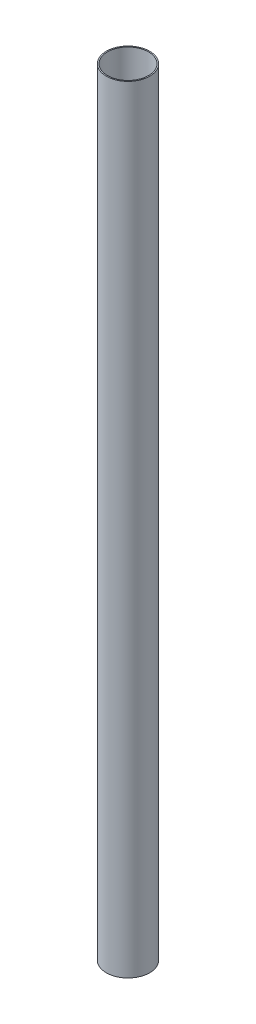
ISO-10303-21;
HEADER;
FILE_DESCRIPTION(('STEP AP214'),'2;1');
FILE_NAME('part.step','',(''),(''),'','','');
FILE_SCHEMA(('AUTOMOTIVE_DESIGN { 1 0 10303 214 1 1 1 1 }'));
ENDSEC;
DATA;
#1=APPLICATION_CONTEXT('core data for automotive mechanical design processes');
#2=APPLICATION_PROTOCOL_DEFINITION('international standard','automotive_design',2000,#1);
#3=PRODUCT_CONTEXT('',#1,'mechanical');
#4=PRODUCT('Part','Part','',(#3));
#5=PRODUCT_RELATED_PRODUCT_CATEGORY('part','',(#4));
#6=PRODUCT_DEFINITION_FORMATION('','',#4);
#7=PRODUCT_DEFINITION_CONTEXT('part definition',#1,'design');
#8=PRODUCT_DEFINITION('design','',#6,#7);
#9=PRODUCT_DEFINITION_SHAPE('','',#8);
#10=(LENGTH_UNIT() NAMED_UNIT(*) SI_UNIT(.MILLI.,.METRE.));
#11=(NAMED_UNIT(*) PLANE_ANGLE_UNIT() SI_UNIT($,.RADIAN.));
#12=(NAMED_UNIT(*) SI_UNIT($,.STERADIAN.) SOLID_ANGLE_UNIT());
#13=UNCERTAINTY_MEASURE_WITH_UNIT(LENGTH_MEASURE(1.E-05),#10,'distance_accuracy_value','');
#14=(GEOMETRIC_REPRESENTATION_CONTEXT(3) GLOBAL_UNCERTAINTY_ASSIGNED_CONTEXT((#13)) GLOBAL_UNIT_ASSIGNED_CONTEXT((#10,
#11,#12)) REPRESENTATION_CONTEXT('',''));
#15=CARTESIAN_POINT('',(0.,0.,0.));
#16=DIRECTION('',(0.,0.,1.));
#17=DIRECTION('',(1.,0.,0.));
#18=AXIS2_PLACEMENT_3D('',#15,#16,#17);
#19=CARTESIAN_POINT('',(0.,1146.81,0.));
#20=DIRECTION('',(0.,1.,0.));
#21=DIRECTION('',(0.,0.,1.));
#22=AXIS2_PLACEMENT_3D('',#19,#20,#21);
#23=CYLINDRICAL_SURFACE('',#22,26.9747999999999);
#24=CARTESIAN_POINT('',(0.,0.,0.));
#25=DIRECTION('',(0.,1.,0.));
#26=DIRECTION('',(0.,0.,1.));
#27=AXIS2_PLACEMENT_3D('',#24,#25,#26);
#28=CIRCLE('',#27,26.9748);
#29=CARTESIAN_POINT('',(0.,0.,26.9748));
#30=VERTEX_POINT('',#29);
#31=EDGE_CURVE('E10',#30,#30,#28,.T.);
#32=ORIENTED_EDGE('',*,*,#31,.F.);
#33=EDGE_LOOP('',(#32));
#34=FACE_BOUND('',#33,.T.);
#35=CARTESIAN_POINT('',(0.,1019.9878,0.));
#36=DIRECTION('',(0.,1.,0.));
#37=DIRECTION('',(0.,0.,1.));
#38=AXIS2_PLACEMENT_3D('',#35,#36,#37);
#39=CIRCLE('',#38,26.9747999999999);
#40=CARTESIAN_POINT('',(0.,1019.9878,26.9747999999999));
#41=VERTEX_POINT('',#40);
#42=EDGE_CURVE('E50',#41,#41,#39,.T.);
#43=ORIENTED_EDGE('',*,*,#42,.T.);
#44=EDGE_LOOP('',(#43));
#45=FACE_BOUND('',#44,.T.);
#46=ADVANCED_FACE('F36',(#34,#45),#23,.F.);
#47=CARTESIAN_POINT('',(26.9748,0.,0.));
#48=DIRECTION('',(0.,1.,0.));
#49=DIRECTION('',(0.,0.,1.));
#50=AXIS2_PLACEMENT_3D('',#47,#48,#49);
#51=PLANE('',#50);
#52=CARTESIAN_POINT('',(0.,0.,0.));
#53=DIRECTION('',(0.,1.,0.));
#54=DIRECTION('',(0.,0.,1.));
#55=AXIS2_PLACEMENT_3D('',#52,#53,#54);
#56=CIRCLE('',#55,28.4988);
#57=CARTESIAN_POINT('',(0.,0.,28.4988));
#58=VERTEX_POINT('',#57);
#59=EDGE_CURVE('E42',#58,#58,#56,.T.);
#60=ORIENTED_EDGE('',*,*,#59,.F.);
#61=EDGE_LOOP('',(#60));
#62=FACE_BOUND('',#61,.T.);
#63=ORIENTED_EDGE('',*,*,#31,.T.);
#64=EDGE_LOOP('',(#63));
#65=FACE_BOUND('',#64,.T.);
#66=ADVANCED_FACE('F65',(#62,#65),#51,.F.);
#67=CARTESIAN_POINT('',(0.,1146.81,0.));
#68=DIRECTION('',(0.,1.,0.));
#69=DIRECTION('',(0.,0.,1.));
#70=AXIS2_PLACEMENT_3D('',#67,#68,#69);
#71=CYLINDRICAL_SURFACE('',#70,28.4987999999999);
#72=CARTESIAN_POINT('',(0.,1019.9878,0.));
#73=DIRECTION('',(0.,1.,0.));
#74=DIRECTION('',(0.,0.,1.));
#75=AXIS2_PLACEMENT_3D('',#72,#73,#74);
#76=CIRCLE('',#75,28.4987999999999);
#77=CARTESIAN_POINT('',(0.,1019.9878,28.4987999999999));
#78=VERTEX_POINT('',#77);
#79=EDGE_CURVE('E46',#78,#78,#76,.T.);
#80=ORIENTED_EDGE('',*,*,#79,.F.);
#81=EDGE_LOOP('',(#80));
#82=FACE_BOUND('',#81,.T.);
#83=ORIENTED_EDGE('',*,*,#59,.T.);
#84=EDGE_LOOP('',(#83));
#85=FACE_BOUND('',#84,.T.);
#86=ADVANCED_FACE('F60',(#82,#85),#71,.T.);
#87=CARTESIAN_POINT('',(26.9747999999999,1019.9878,0.));
#88=DIRECTION('',(0.,-1.,0.));
#89=DIRECTION('',(0.,0.,-1.));
#90=AXIS2_PLACEMENT_3D('',#87,#88,#89);
#91=PLANE('',#90);
#92=ORIENTED_EDGE('',*,*,#42,.F.);
#93=EDGE_LOOP('',(#92));
#94=FACE_BOUND('',#93,.T.);
#95=ORIENTED_EDGE('',*,*,#79,.T.);
#96=EDGE_LOOP('',(#95));
#97=FACE_BOUND('',#96,.T.);
#98=ADVANCED_FACE('F57',(#94,#97),#91,.F.);
#99=CLOSED_SHELL('',(#46,#66,#86,#98));
#100=MANIFOLD_SOLID_BREP('B2',#99);
#101=ADVANCED_BREP_SHAPE_REPRESENTATION('',(#18,#100),#14);
#102=SHAPE_DEFINITION_REPRESENTATION(#9,#101);
ENDSEC;
END-ISO-10303-21;
